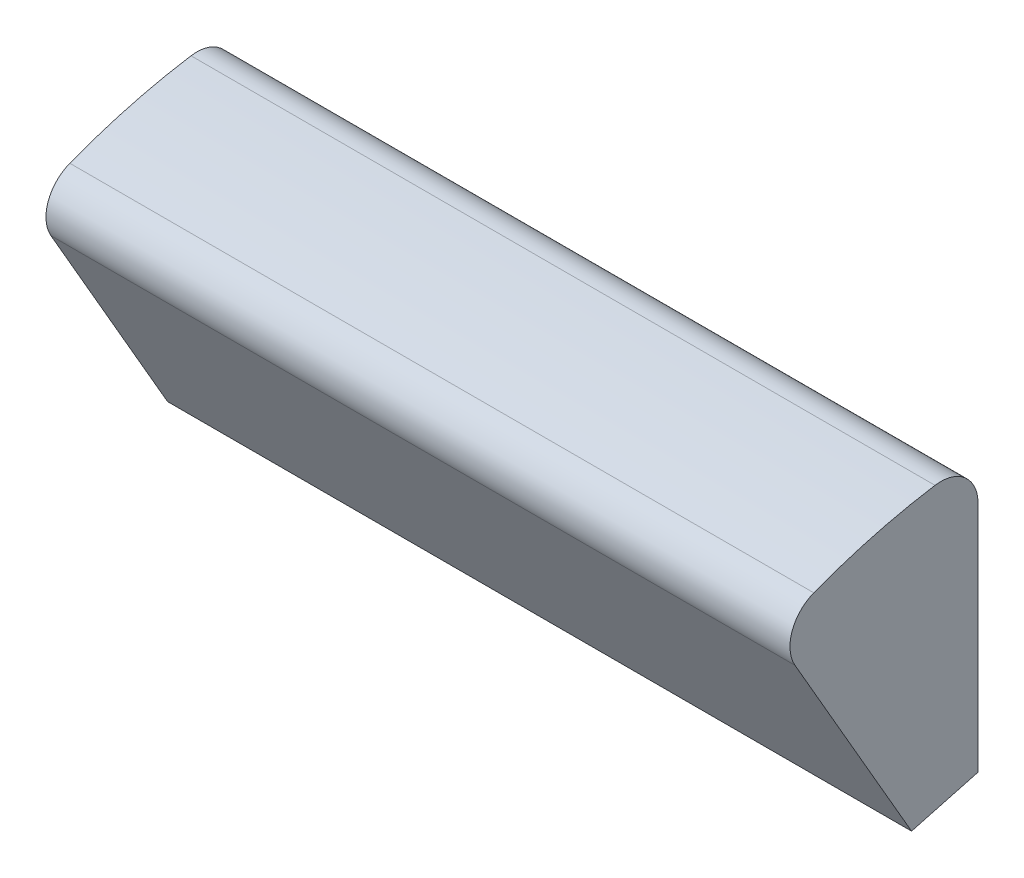
ISO-10303-21;
HEADER;
FILE_DESCRIPTION(('STEP AP214'),'2;1');
FILE_NAME('part.step','',(''),(''),'','','');
FILE_SCHEMA(('AUTOMOTIVE_DESIGN { 1 0 10303 214 1 1 1 1 }'));
ENDSEC;
DATA;
#1=APPLICATION_CONTEXT('core data for automotive mechanical design processes');
#2=APPLICATION_PROTOCOL_DEFINITION('international standard','automotive_design',2000,#1);
#3=PRODUCT_CONTEXT('',#1,'mechanical');
#4=PRODUCT('Part','Part','',(#3));
#5=PRODUCT_RELATED_PRODUCT_CATEGORY('part','',(#4));
#6=PRODUCT_DEFINITION_FORMATION('','',#4);
#7=PRODUCT_DEFINITION_CONTEXT('part definition',#1,'design');
#8=PRODUCT_DEFINITION('design','',#6,#7);
#9=PRODUCT_DEFINITION_SHAPE('','',#8);
#10=(LENGTH_UNIT() NAMED_UNIT(*) SI_UNIT(.MILLI.,.METRE.));
#11=(NAMED_UNIT(*) PLANE_ANGLE_UNIT() SI_UNIT($,.RADIAN.));
#12=(NAMED_UNIT(*) SI_UNIT($,.STERADIAN.) SOLID_ANGLE_UNIT());
#13=UNCERTAINTY_MEASURE_WITH_UNIT(LENGTH_MEASURE(1.E-05),#10,'distance_accuracy_value','');
#14=(GEOMETRIC_REPRESENTATION_CONTEXT(3) GLOBAL_UNCERTAINTY_ASSIGNED_CONTEXT((#13)) GLOBAL_UNIT_ASSIGNED_CONTEXT((#10,
#11,#12)) REPRESENTATION_CONTEXT('',''));
#15=CARTESIAN_POINT('',(0.,0.,0.));
#16=DIRECTION('',(0.,0.,1.));
#17=DIRECTION('',(1.,0.,0.));
#18=AXIS2_PLACEMENT_3D('',#15,#16,#17);
#19=CARTESIAN_POINT('',(30.,22.2261107708929,3.5));
#20=DIRECTION('',(-1.,0.,0.));
#21=DIRECTION('',(0.,0.,1.));
#22=AXIS2_PLACEMENT_3D('',#19,#20,#21);
#23=CYLINDRICAL_SURFACE('',#22,1.5);
#24=CARTESIAN_POINT('',(0.,22.2261107708929,3.5));
#25=DIRECTION('',(1.,0.,0.));
#26=DIRECTION('',(0.,0.,-1.));
#27=AXIS2_PLACEMENT_3D('',#24,#25,#26);
#28=CIRCLE('',#27,1.5);
#29=CARTESIAN_POINT('',(0.,22.2261107708929,2.));
#30=VERTEX_POINT('',#29);
#31=CARTESIAN_POINT('',(0.,23.7078514889524,3.73333333333333));
#32=VERTEX_POINT('',#31);
#33=EDGE_CURVE('E121',#30,#32,#28,.T.);
#34=ORIENTED_EDGE('',*,*,#33,.T.);
#35=DIRECTION('',(-1.,0.,0.));
#36=VECTOR('',#35,1.);
#37=CARTESIAN_POINT('',(30.,23.7078514889524,3.73333333333333));
#38=LINE('',#37,#36);
#39=CARTESIAN_POINT('',(30.,23.7078514889524,3.73333333333333));
#40=VERTEX_POINT('',#39);
#41=EDGE_CURVE('E11',#40,#32,#38,.T.);
#42=ORIENTED_EDGE('',*,*,#41,.F.);
#43=CARTESIAN_POINT('',(30.,22.2261107708929,3.5));
#44=DIRECTION('',(1.,0.,0.));
#45=DIRECTION('',(0.,0.,-1.));
#46=AXIS2_PLACEMENT_3D('',#43,#44,#45);
#47=CIRCLE('',#46,1.5);
#48=CARTESIAN_POINT('',(30.,22.2261107708929,2.));
#49=VERTEX_POINT('',#48);
#50=EDGE_CURVE('E131',#49,#40,#47,.T.);
#51=ORIENTED_EDGE('',*,*,#50,.F.);
#52=DIRECTION('',(-1.,0.,0.));
#53=VECTOR('',#52,1.);
#54=CARTESIAN_POINT('',(30.,22.2261107708929,2.));
#55=LINE('',#54,#53);
#56=EDGE_CURVE('E117',#49,#30,#55,.T.);
#57=ORIENTED_EDGE('',*,*,#56,.T.);
#58=EDGE_LOOP('',(#34,#42,#51,#57));
#59=FACE_BOUND('',#58,.T.);
#60=ADVANCED_FACE('F37',(#59),#23,.T.);
#61=CARTESIAN_POINT('',(30.,0.,0.));
#62=DIRECTION('',(-1.,0.,0.));
#63=DIRECTION('',(0.,0.,1.));
#64=AXIS2_PLACEMENT_3D('',#61,#62,#63);
#65=CYLINDRICAL_SURFACE('',#64,24.);
#66=CARTESIAN_POINT('',(0.,0.,0.));
#67=DIRECTION('',(1.,0.,0.));
#68=DIRECTION('',(0.,0.,1.));
#69=AXIS2_PLACEMENT_3D('',#66,#67,#68);
#70=CIRCLE('',#69,24.);
#71=CARTESIAN_POINT('',(0.,22.3982683252482,8.62076423701433));
#72=VERTEX_POINT('',#71);
#73=EDGE_CURVE('E124',#32,#72,#70,.T.);
#74=ORIENTED_EDGE('',*,*,#73,.T.);
#75=DIRECTION('',(-1.,0.,0.));
#76=VECTOR('',#75,1.);
#77=CARTESIAN_POINT('',(30.,22.3982683252482,8.62076423701433));
#78=LINE('',#77,#76);
#79=CARTESIAN_POINT('',(30.,22.3982683252482,8.62076423701433));
#80=VERTEX_POINT('',#79);
#81=EDGE_CURVE('E45',#80,#72,#78,.T.);
#82=ORIENTED_EDGE('',*,*,#81,.F.);
#83=CARTESIAN_POINT('',(30.,0.,0.));
#84=DIRECTION('',(1.,0.,0.));
#85=DIRECTION('',(0.,0.,1.));
#86=AXIS2_PLACEMENT_3D('',#83,#84,#85);
#87=CIRCLE('',#86,24.);
#88=EDGE_CURVE('E90',#40,#80,#87,.T.);
#89=ORIENTED_EDGE('',*,*,#88,.F.);
#90=ORIENTED_EDGE('',*,*,#41,.T.);
#91=EDGE_LOOP('',(#74,#82,#89,#90));
#92=FACE_BOUND('',#91,.T.);
#93=ADVANCED_FACE('F155',(#92),#65,.T.);
#94=CARTESIAN_POINT('',(30.,20.9983765549201,8.08196647220093));
#95=DIRECTION('',(-1.,0.,0.));
#96=DIRECTION('',(0.,0.,1.));
#97=AXIS2_PLACEMENT_3D('',#94,#95,#96);
#98=CYLINDRICAL_SURFACE('',#97,1.5);
#99=CARTESIAN_POINT('',(0.,20.9983765549201,8.08196647220093));
#100=DIRECTION('',(1.,0.,0.));
#101=DIRECTION('',(0.,0.,-1.));
#102=AXIS2_PLACEMENT_3D('',#99,#100,#101);
#103=CIRCLE('',#102,1.5);
#104=CARTESIAN_POINT('',(0.,20.2483765549201,9.38100457787759));
#105=VERTEX_POINT('',#104);
#106=EDGE_CURVE('E126',#72,#105,#103,.T.);
#107=ORIENTED_EDGE('',*,*,#106,.T.);
#108=DIRECTION('',(-1.,0.,0.));
#109=VECTOR('',#108,1.);
#110=CARTESIAN_POINT('',(30.,20.2483765549201,9.38100457787759));
#111=LINE('',#110,#109);
#112=CARTESIAN_POINT('',(30.,20.2483765549201,9.38100457787759));
#113=VERTEX_POINT('',#112);
#114=EDGE_CURVE('E112',#113,#105,#111,.T.);
#115=ORIENTED_EDGE('',*,*,#114,.F.);
#116=CARTESIAN_POINT('',(30.,20.9983765549201,8.08196647220093));
#117=DIRECTION('',(1.,0.,0.));
#118=DIRECTION('',(0.,0.,-1.));
#119=AXIS2_PLACEMENT_3D('',#116,#117,#118);
#120=CIRCLE('',#119,1.5);
#121=EDGE_CURVE('E103',#80,#113,#120,.T.);
#122=ORIENTED_EDGE('',*,*,#121,.F.);
#123=ORIENTED_EDGE('',*,*,#81,.T.);
#124=EDGE_LOOP('',(#107,#115,#122,#123));
#125=FACE_BOUND('',#124,.T.);
#126=ADVANCED_FACE('F137',(#125),#98,.T.);
#127=CARTESIAN_POINT('',(30.,20.2483765549201,9.38100457787759));
#128=DIRECTION('',(0.,0.5,-0.866025403784439));
#129=DIRECTION('',(0.,0.866025403784439,0.5));
#130=AXIS2_PLACEMENT_3D('',#127,#128,#129);
#131=PLANE('',#130);
#132=DIRECTION('',(0.,-0.866025403784439,-0.5));
#133=VECTOR('',#132,1.);
#134=CARTESIAN_POINT('',(0.,20.2483765549201,9.38100457787759));
#135=LINE('',#134,#133);
#136=CARTESIAN_POINT('',(0.,12.1041279027124,4.67892042617818));
#137=VERTEX_POINT('',#136);
#138=EDGE_CURVE('E111',#105,#137,#135,.T.);
#139=ORIENTED_EDGE('',*,*,#138,.T.);
#140=DIRECTION('',(-1.,0.,0.));
#141=VECTOR('',#140,1.);
#142=CARTESIAN_POINT('',(30.,12.1041279027124,4.67892042617818));
#143=LINE('',#142,#141);
#144=CARTESIAN_POINT('',(30.,12.1041279027124,4.67892042617818));
#145=VERTEX_POINT('',#144);
#146=EDGE_CURVE('E108',#145,#137,#143,.T.);
#147=ORIENTED_EDGE('',*,*,#146,.F.);
#148=DIRECTION('',(0.,-0.866025403784439,-0.5));
#149=VECTOR('',#148,1.);
#150=CARTESIAN_POINT('',(30.,20.2483765549201,9.38100457787759));
#151=LINE('',#150,#149);
#152=EDGE_CURVE('E97',#113,#145,#151,.T.);
#153=ORIENTED_EDGE('',*,*,#152,.F.);
#154=ORIENTED_EDGE('',*,*,#114,.T.);
#155=EDGE_LOOP('',(#139,#147,#153,#154));
#156=FACE_BOUND('',#155,.T.);
#157=ADVANCED_FACE('F109',(#156),#131,.F.);
#158=CARTESIAN_POINT('',(30.,12.1041279027124,4.67892042617818));
#159=DIRECTION('',(0.,0.965925826289082,0.258819045102471));
#160=DIRECTION('',(0.,-0.258819045102471,0.965925826289082));
#161=AXIS2_PLACEMENT_3D('',#158,#159,#160);
#162=PLANE('',#161);
#163=DIRECTION('',(0.,0.258819045102471,-0.965925826289082));
#164=VECTOR('',#163,1.);
#165=CARTESIAN_POINT('',(0.,12.1041279027124,4.67892042617818));
#166=LINE('',#165,#164);
#167=CARTESIAN_POINT('',(0.,12.8219424674939,2.));
#168=VERTEX_POINT('',#167);
#169=EDGE_CURVE('E76',#137,#168,#166,.T.);
#170=ORIENTED_EDGE('',*,*,#169,.T.);
#171=DIRECTION('',(-1.,0.,0.));
#172=VECTOR('',#171,1.);
#173=CARTESIAN_POINT('',(30.,12.8219424674939,2.));
#174=LINE('',#173,#172);
#175=CARTESIAN_POINT('',(30.,12.8219424674939,2.));
#176=VERTEX_POINT('',#175);
#177=EDGE_CURVE('E113',#176,#168,#174,.T.);
#178=ORIENTED_EDGE('',*,*,#177,.F.);
#179=DIRECTION('',(0.,0.258819045102471,-0.965925826289082));
#180=VECTOR('',#179,1.);
#181=CARTESIAN_POINT('',(30.,12.1041279027124,4.67892042617818));
#182=LINE('',#181,#180);
#183=EDGE_CURVE('E101',#145,#176,#182,.T.);
#184=ORIENTED_EDGE('',*,*,#183,.F.);
#185=ORIENTED_EDGE('',*,*,#146,.T.);
#186=EDGE_LOOP('',(#170,#178,#184,#185));
#187=FACE_BOUND('',#186,.T.);
#188=ADVANCED_FACE('F115',(#187),#162,.F.);
#189=CARTESIAN_POINT('',(30.,22.2261107708929,2.));
#190=DIRECTION('',(0.,0.,1.));
#191=DIRECTION('',(1.,0.,0.));
#192=AXIS2_PLACEMENT_3D('',#189,#190,#191);
#193=PLANE('',#192);
#194=DIRECTION('',(0.,1.,0.));
#195=VECTOR('',#194,1.);
#196=CARTESIAN_POINT('',(0.,22.2261107708929,2.));
#197=LINE('',#196,#195);
#198=EDGE_CURVE('E82',#168,#30,#197,.T.);
#199=ORIENTED_EDGE('',*,*,#198,.T.);
#200=ORIENTED_EDGE('',*,*,#56,.F.);
#201=DIRECTION('',(0.,1.,0.));
#202=VECTOR('',#201,1.);
#203=CARTESIAN_POINT('',(30.,22.2261107708929,2.));
#204=LINE('',#203,#202);
#205=EDGE_CURVE('E53',#176,#49,#204,.T.);
#206=ORIENTED_EDGE('',*,*,#205,.F.);
#207=ORIENTED_EDGE('',*,*,#177,.T.);
#208=EDGE_LOOP('',(#199,#200,#206,#207));
#209=FACE_BOUND('',#208,.T.);
#210=ADVANCED_FACE('F144',(#209),#193,.F.);
#211=CARTESIAN_POINT('',(30.,22.2261107708929,3.5));
#212=DIRECTION('',(1.,0.,0.));
#213=DIRECTION('',(0.,0.,-1.));
#214=AXIS2_PLACEMENT_3D('',#211,#212,#213);
#215=PLANE('',#214);
#216=ORIENTED_EDGE('',*,*,#50,.T.);
#217=ORIENTED_EDGE('',*,*,#88,.T.);
#218=ORIENTED_EDGE('',*,*,#121,.T.);
#219=ORIENTED_EDGE('',*,*,#152,.T.);
#220=ORIENTED_EDGE('',*,*,#183,.T.);
#221=ORIENTED_EDGE('',*,*,#205,.T.);
#222=EDGE_LOOP('',(#216,#217,#218,#219,#220,#221));
#223=FACE_BOUND('',#222,.T.);
#224=ADVANCED_FACE('F99',(#223),#215,.T.);
#225=CARTESIAN_POINT('',(0.,22.2261107708929,3.5));
#226=DIRECTION('',(1.,0.,0.));
#227=DIRECTION('',(0.,0.,-1.));
#228=AXIS2_PLACEMENT_3D('',#225,#226,#227);
#229=PLANE('',#228);
#230=ORIENTED_EDGE('',*,*,#33,.F.);
#231=ORIENTED_EDGE('',*,*,#198,.F.);
#232=ORIENTED_EDGE('',*,*,#169,.F.);
#233=ORIENTED_EDGE('',*,*,#138,.F.);
#234=ORIENTED_EDGE('',*,*,#106,.F.);
#235=ORIENTED_EDGE('',*,*,#73,.F.);
#236=EDGE_LOOP('',(#230,#231,#232,#233,#234,#235));
#237=FACE_BOUND('',#236,.T.);
#238=ADVANCED_FACE('F140',(#237),#229,.F.);
#239=CLOSED_SHELL('',(#60,#93,#126,#157,#188,#210,#224,#238));
#240=MANIFOLD_SOLID_BREP('B2',#239);
#241=ADVANCED_BREP_SHAPE_REPRESENTATION('',(#18,#240),#14);
#242=SHAPE_DEFINITION_REPRESENTATION(#9,#241);
ENDSEC;
END-ISO-10303-21;
